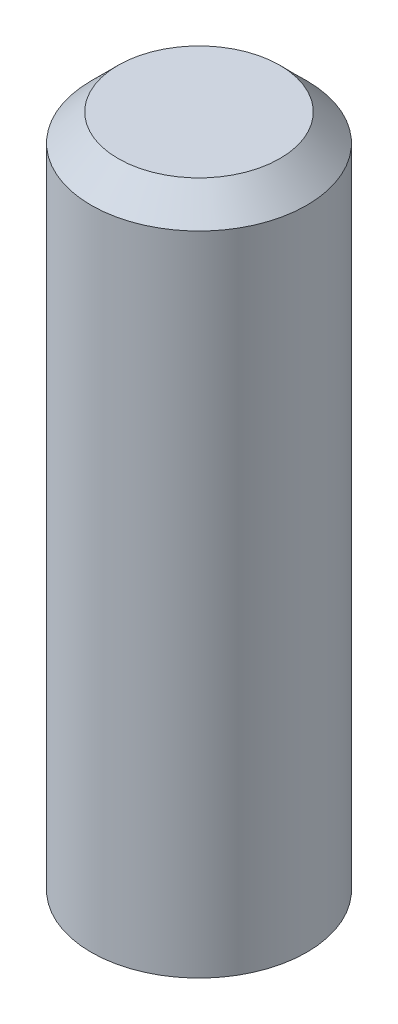
ISO-10303-21;
HEADER;
FILE_DESCRIPTION(('STEP AP214'),'2;1');
FILE_NAME('part.step','',(''),(''),'','','');
FILE_SCHEMA(('AUTOMOTIVE_DESIGN { 1 0 10303 214 1 1 1 1 }'));
ENDSEC;
DATA;
#1=APPLICATION_CONTEXT('core data for automotive mechanical design processes');
#2=APPLICATION_PROTOCOL_DEFINITION('international standard','automotive_design',2000,#1);
#3=PRODUCT_CONTEXT('',#1,'mechanical');
#4=PRODUCT('Part','Part','',(#3));
#5=PRODUCT_RELATED_PRODUCT_CATEGORY('part','',(#4));
#6=PRODUCT_DEFINITION_FORMATION('','',#4);
#7=PRODUCT_DEFINITION_CONTEXT('part definition',#1,'design');
#8=PRODUCT_DEFINITION('design','',#6,#7);
#9=PRODUCT_DEFINITION_SHAPE('','',#8);
#10=(LENGTH_UNIT() NAMED_UNIT(*) SI_UNIT(.MILLI.,.METRE.));
#11=(NAMED_UNIT(*) PLANE_ANGLE_UNIT() SI_UNIT($,.RADIAN.));
#12=(NAMED_UNIT(*) SI_UNIT($,.STERADIAN.) SOLID_ANGLE_UNIT());
#13=UNCERTAINTY_MEASURE_WITH_UNIT(LENGTH_MEASURE(1.E-05),#10,'distance_accuracy_value','');
#14=(GEOMETRIC_REPRESENTATION_CONTEXT(3) GLOBAL_UNCERTAINTY_ASSIGNED_CONTEXT((#13)) GLOBAL_UNIT_ASSIGNED_CONTEXT((#10,
#11,#12)) REPRESENTATION_CONTEXT('',''));
#15=CARTESIAN_POINT('',(0.,0.,0.));
#16=DIRECTION('',(0.,0.,1.));
#17=DIRECTION('',(1.,0.,0.));
#18=AXIS2_PLACEMENT_3D('',#15,#16,#17);
#19=CARTESIAN_POINT('',(0.,25.,0.));
#20=DIRECTION('',(0.,-1.,0.));
#21=DIRECTION('',(0.,0.,-1.));
#22=AXIS2_PLACEMENT_3D('',#19,#20,#21);
#23=CYLINDRICAL_SURFACE('',#22,4.);
#24=CARTESIAN_POINT('',(0.,24.,0.));
#25=DIRECTION('',(0.,1.,0.));
#26=DIRECTION('',(0.,0.,1.));
#27=AXIS2_PLACEMENT_3D('',#24,#25,#26);
#28=CIRCLE('',#27,4.);
#29=CARTESIAN_POINT('',(0.,24.,4.));
#30=VERTEX_POINT('',#29);
#31=EDGE_CURVE('E11',#30,#30,#28,.F.);
#32=ORIENTED_EDGE('',*,*,#31,.T.);
#33=EDGE_LOOP('',(#32));
#34=FACE_BOUND('',#33,.T.);
#35=CARTESIAN_POINT('',(0.,0.,0.));
#36=DIRECTION('',(0.,1.,0.));
#37=DIRECTION('',(0.,0.,1.));
#38=AXIS2_PLACEMENT_3D('',#35,#36,#37);
#39=CIRCLE('',#38,4.);
#40=CARTESIAN_POINT('',(0.,0.,4.));
#41=VERTEX_POINT('',#40);
#42=EDGE_CURVE('E52',#41,#41,#39,.T.);
#43=ORIENTED_EDGE('',*,*,#42,.T.);
#44=EDGE_LOOP('',(#43));
#45=FACE_BOUND('',#44,.T.);
#46=ADVANCED_FACE('F33',(#34,#45),#23,.T.);
#47=CARTESIAN_POINT('',(0.,25.,0.));
#48=DIRECTION('',(0.,1.,0.));
#49=DIRECTION('',(0.,0.,1.));
#50=AXIS2_PLACEMENT_3D('',#47,#48,#49);
#51=PLANE('',#50);
#52=CARTESIAN_POINT('',(0.,25.,0.));
#53=DIRECTION('',(0.,1.,0.));
#54=DIRECTION('',(0.,0.,1.));
#55=AXIS2_PLACEMENT_3D('',#52,#53,#54);
#56=CIRCLE('',#55,3.);
#57=CARTESIAN_POINT('',(0.,25.,3.));
#58=VERTEX_POINT('',#57);
#59=EDGE_CURVE('E40',#58,#58,#56,.T.);
#60=ORIENTED_EDGE('',*,*,#59,.T.);
#61=EDGE_LOOP('',(#60));
#62=FACE_BOUND('',#61,.T.);
#63=ADVANCED_FACE('F62',(#62),#51,.T.);
#64=CARTESIAN_POINT('',(0.,0.,0.));
#65=DIRECTION('',(0.,1.,0.));
#66=DIRECTION('',(0.,0.,1.));
#67=AXIS2_PLACEMENT_3D('',#64,#65,#66);
#68=PLANE('',#67);
#69=CARTESIAN_POINT('',(0.,0.,0.));
#70=DIRECTION('',(0.,-1.,0.));
#71=DIRECTION('',(0.,0.,-1.));
#72=AXIS2_PLACEMENT_3D('',#69,#70,#71);
#73=CIRCLE('',#72,2.09999999999999);
#74=CARTESIAN_POINT('',(0.,0.,-2.09999999999999));
#75=VERTEX_POINT('',#74);
#76=EDGE_CURVE('E53',#75,#75,#73,.T.);
#77=ORIENTED_EDGE('',*,*,#76,.F.);
#78=EDGE_LOOP('',(#77));
#79=FACE_BOUND('',#78,.T.);
#80=ORIENTED_EDGE('',*,*,#42,.F.);
#81=EDGE_LOOP('',(#80));
#82=FACE_BOUND('',#81,.T.);
#83=ADVANCED_FACE('F65',(#79,#82),#68,.F.);
#84=CARTESIAN_POINT('',(0.,25.,0.));
#85=DIRECTION('',(0.,-1.,0.));
#86=DIRECTION('',(0.,0.,-1.));
#87=AXIS2_PLACEMENT_3D('',#84,#85,#86);
#88=CONICAL_SURFACE('',#87,3.,0.785398163397447);
#89=ORIENTED_EDGE('',*,*,#31,.F.);
#90=EDGE_LOOP('',(#89));
#91=FACE_BOUND('',#90,.T.);
#92=ORIENTED_EDGE('',*,*,#59,.F.);
#93=EDGE_LOOP('',(#92));
#94=FACE_BOUND('',#93,.T.);
#95=ADVANCED_FACE('F35',(#91,#94),#88,.T.);
#96=CARTESIAN_POINT('',(0.,6.,0.));
#97=DIRECTION('',(0.,-1.,0.));
#98=DIRECTION('',(0.,0.,-1.));
#99=AXIS2_PLACEMENT_3D('',#96,#97,#98);
#100=CONICAL_SURFACE('',#99,2.1,1.02974425867665);
#101=CARTESIAN_POINT('',(0.,7.26180729995788,0.));
#102=VERTEX_POINT('',#101);
#103=VERTEX_LOOP('',#102);
#104=FACE_BOUND('',#103,.T.);
#105=CARTESIAN_POINT('',(0.,6.,0.));
#106=DIRECTION('',(0.,-1.,0.));
#107=DIRECTION('',(0.,0.,-1.));
#108=AXIS2_PLACEMENT_3D('',#105,#106,#107);
#109=CIRCLE('',#108,2.1);
#110=CARTESIAN_POINT('',(0.,6.,-2.1));
#111=VERTEX_POINT('',#110);
#112=EDGE_CURVE('E50',#111,#111,#109,.T.);
#113=ORIENTED_EDGE('',*,*,#112,.T.);
#114=EDGE_LOOP('',(#113));
#115=FACE_BOUND('',#114,.T.);
#116=ADVANCED_FACE('F43',(#104,#115),#100,.F.);
#117=CARTESIAN_POINT('',(0.,0.,0.));
#118=DIRECTION('',(0.,-1.,0.));
#119=DIRECTION('',(0.,0.,-1.));
#120=AXIS2_PLACEMENT_3D('',#117,#118,#119);
#121=CYLINDRICAL_SURFACE('',#120,2.09999999999999);
#122=ORIENTED_EDGE('',*,*,#112,.F.);
#123=EDGE_LOOP('',(#122));
#124=FACE_BOUND('',#123,.T.);
#125=ORIENTED_EDGE('',*,*,#76,.T.);
#126=EDGE_LOOP('',(#125));
#127=FACE_BOUND('',#126,.T.);
#128=ADVANCED_FACE('F46',(#124,#127),#121,.F.);
#129=CLOSED_SHELL('',(#46,#63,#83,#95,#116,#128));
#130=MANIFOLD_SOLID_BREP('B2',#129);
#131=ADVANCED_BREP_SHAPE_REPRESENTATION('',(#18,#130),#14);
#132=SHAPE_DEFINITION_REPRESENTATION(#9,#131);
ENDSEC;
END-ISO-10303-21;
